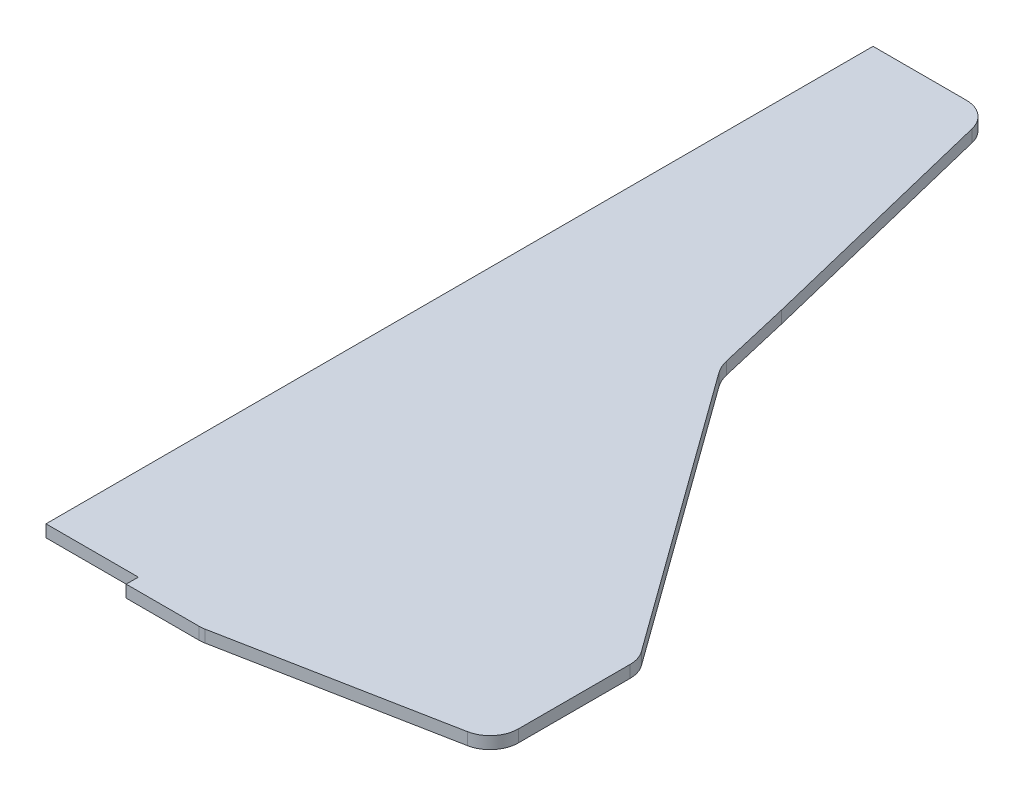
ISO-10303-21;
HEADER;
FILE_DESCRIPTION(('STEP AP214'),'2;1');
FILE_NAME('part.step','',(''),(''),'','','');
FILE_SCHEMA(('AUTOMOTIVE_DESIGN { 1 0 10303 214 1 1 1 1 }'));
ENDSEC;
DATA;
#1=APPLICATION_CONTEXT('core data for automotive mechanical design processes');
#2=APPLICATION_PROTOCOL_DEFINITION('international standard','automotive_design',2000,#1);
#3=PRODUCT_CONTEXT('',#1,'mechanical');
#4=PRODUCT('Part','Part','',(#3));
#5=PRODUCT_RELATED_PRODUCT_CATEGORY('part','',(#4));
#6=PRODUCT_DEFINITION_FORMATION('','',#4);
#7=PRODUCT_DEFINITION_CONTEXT('part definition',#1,'design');
#8=PRODUCT_DEFINITION('design','',#6,#7);
#9=PRODUCT_DEFINITION_SHAPE('','',#8);
#10=(LENGTH_UNIT() NAMED_UNIT(*) SI_UNIT(.MILLI.,.METRE.));
#11=(NAMED_UNIT(*) PLANE_ANGLE_UNIT() SI_UNIT($,.RADIAN.));
#12=(NAMED_UNIT(*) SI_UNIT($,.STERADIAN.) SOLID_ANGLE_UNIT());
#13=UNCERTAINTY_MEASURE_WITH_UNIT(LENGTH_MEASURE(1.E-05),#10,'distance_accuracy_value','');
#14=(GEOMETRIC_REPRESENTATION_CONTEXT(3) GLOBAL_UNCERTAINTY_ASSIGNED_CONTEXT((#13)) GLOBAL_UNIT_ASSIGNED_CONTEXT((#10,
#11,#12)) REPRESENTATION_CONTEXT('',''));
#15=CARTESIAN_POINT('',(0.,0.,0.));
#16=DIRECTION('',(0.,0.,1.));
#17=DIRECTION('',(1.,0.,0.));
#18=AXIS2_PLACEMENT_3D('',#15,#16,#17);
#19=CARTESIAN_POINT('',(0.,3.,18.1954132350214));
#20=DIRECTION('',(0.,0.,1.));
#21=DIRECTION('',(1.,0.,0.));
#22=AXIS2_PLACEMENT_3D('',#19,#20,#21);
#23=PLANE('',#22);
#24=DIRECTION('',(-1.,0.,0.));
#25=VECTOR('',#24,1.);
#26=CARTESIAN_POINT('',(0.,0.,18.1954132350214));
#27=LINE('',#26,#25);
#28=CARTESIAN_POINT('',(0.,0.,18.1954132350214));
#29=VERTEX_POINT('',#28);
#30=CARTESIAN_POINT('',(-22.78,0.,18.1954132350214));
#31=VERTEX_POINT('',#30);
#32=EDGE_CURVE('E186',#29,#31,#27,.T.);
#33=ORIENTED_EDGE('',*,*,#32,.F.);
#34=DIRECTION('',(0.,-1.,0.));
#35=VECTOR('',#34,1.);
#36=CARTESIAN_POINT('',(0.,3.,18.1954132350214));
#37=LINE('',#36,#35);
#38=CARTESIAN_POINT('',(0.,3.,18.1954132350214));
#39=VERTEX_POINT('',#38);
#40=EDGE_CURVE('E11',#39,#29,#37,.T.);
#41=ORIENTED_EDGE('',*,*,#40,.F.);
#42=DIRECTION('',(-1.,0.,0.));
#43=VECTOR('',#42,1.);
#44=CARTESIAN_POINT('',(0.,3.,18.1954132350214));
#45=LINE('',#44,#43);
#46=CARTESIAN_POINT('',(-22.78,3.,18.1954132350214));
#47=VERTEX_POINT('',#46);
#48=EDGE_CURVE('E242',#39,#47,#45,.T.);
#49=ORIENTED_EDGE('',*,*,#48,.T.);
#50=DIRECTION('',(0.,-1.,0.));
#51=VECTOR('',#50,1.);
#52=CARTESIAN_POINT('',(-22.78,3.,18.1954132350214));
#53=LINE('',#52,#51);
#54=EDGE_CURVE('E62',#47,#31,#53,.T.);
#55=ORIENTED_EDGE('',*,*,#54,.T.);
#56=EDGE_LOOP('',(#33,#41,#49,#55));
#57=FACE_BOUND('',#56,.T.);
#58=ADVANCED_FACE('F45',(#57),#23,.T.);
#59=CARTESIAN_POINT('',(0.,3.,0.));
#60=DIRECTION('',(1.,0.,0.));
#61=DIRECTION('',(0.,0.,-1.));
#62=AXIS2_PLACEMENT_3D('',#59,#60,#61);
#63=PLANE('',#62);
#64=DIRECTION('',(0.,0.,1.));
#65=VECTOR('',#64,1.);
#66=CARTESIAN_POINT('',(0.,0.,0.));
#67=LINE('',#66,#65);
#68=CARTESIAN_POINT('',(0.,0.,21.1954132350214));
#69=VERTEX_POINT('',#68);
#70=EDGE_CURVE('E189',#29,#69,#67,.T.);
#71=ORIENTED_EDGE('',*,*,#70,.T.);
#72=DIRECTION('',(0.,-1.,0.));
#73=VECTOR('',#72,1.);
#74=CARTESIAN_POINT('',(0.,3.,21.1954132350214));
#75=LINE('',#74,#73);
#76=CARTESIAN_POINT('',(0.,3.,21.1954132350214));
#77=VERTEX_POINT('',#76);
#78=EDGE_CURVE('E54',#77,#69,#75,.T.);
#79=ORIENTED_EDGE('',*,*,#78,.F.);
#80=DIRECTION('',(0.,0.,1.));
#81=VECTOR('',#80,1.);
#82=CARTESIAN_POINT('',(0.,3.,0.));
#83=LINE('',#82,#81);
#84=EDGE_CURVE('E297',#39,#77,#83,.T.);
#85=ORIENTED_EDGE('',*,*,#84,.F.);
#86=ORIENTED_EDGE('',*,*,#40,.T.);
#87=EDGE_LOOP('',(#71,#79,#85,#86));
#88=FACE_BOUND('',#87,.T.);
#89=ADVANCED_FACE('F285',(#88),#63,.F.);
#90=CARTESIAN_POINT('',(0.,3.,21.1954132350214));
#91=DIRECTION('',(0.,0.,1.));
#92=DIRECTION('',(1.,0.,0.));
#93=AXIS2_PLACEMENT_3D('',#90,#91,#92);
#94=PLANE('',#93);
#95=DIRECTION('',(-1.,0.,0.));
#96=VECTOR('',#95,1.);
#97=CARTESIAN_POINT('',(0.,0.,21.1954132350214));
#98=LINE('',#97,#96);
#99=CARTESIAN_POINT('',(18.0015919325886,0.,21.1954132350214));
#100=VERTEX_POINT('',#99);
#101=EDGE_CURVE('E193',#100,#69,#98,.T.);
#102=ORIENTED_EDGE('',*,*,#101,.F.);
#103=DIRECTION('',(0.,-1.,0.));
#104=VECTOR('',#103,1.);
#105=CARTESIAN_POINT('',(18.0015919325886,3.,21.1954132350214));
#106=LINE('',#105,#104);
#107=CARTESIAN_POINT('',(18.0015919325886,3.,21.1954132350214));
#108=VERTEX_POINT('',#107);
#109=EDGE_CURVE('E273',#108,#100,#106,.T.);
#110=ORIENTED_EDGE('',*,*,#109,.F.);
#111=DIRECTION('',(-1.,0.,0.));
#112=VECTOR('',#111,1.);
#113=CARTESIAN_POINT('',(0.,3.,21.1954132350214));
#114=LINE('',#113,#112);
#115=EDGE_CURVE('E282',#108,#77,#114,.T.);
#116=ORIENTED_EDGE('',*,*,#115,.T.);
#117=ORIENTED_EDGE('',*,*,#78,.T.);
#118=EDGE_LOOP('',(#102,#110,#116,#117));
#119=FACE_BOUND('',#118,.T.);
#120=ADVANCED_FACE('F280',(#119),#94,.T.);
#121=CARTESIAN_POINT('',(18.0015919325886,3.,14.1954132350214));
#122=DIRECTION('',(0.,-1.,0.));
#123=DIRECTION('',(0.,0.,-1.));
#124=AXIS2_PLACEMENT_3D('',#121,#122,#123);
#125=CYLINDRICAL_SURFACE('',#124,7.);
#126=CARTESIAN_POINT('',(18.0015919325886,0.,14.1954132350214));
#127=DIRECTION('',(0.,1.,0.));
#128=DIRECTION('',(0.,0.,1.));
#129=AXIS2_PLACEMENT_3D('',#126,#127,#128);
#130=CIRCLE('',#129,7.);
#131=CARTESIAN_POINT('',(19.3262832462842,0.,21.0689271051914));
#132=VERTEX_POINT('',#131);
#133=EDGE_CURVE('E197',#132,#100,#130,.F.);
#134=ORIENTED_EDGE('',*,*,#133,.F.);
#135=DIRECTION('',(0.,-1.,0.));
#136=VECTOR('',#135,1.);
#137=CARTESIAN_POINT('',(19.3262832462842,3.,21.0689271051914));
#138=LINE('',#137,#136);
#139=CARTESIAN_POINT('',(19.3262832462842,3.,21.0689271051914));
#140=VERTEX_POINT('',#139);
#141=EDGE_CURVE('E270',#140,#132,#138,.T.);
#142=ORIENTED_EDGE('',*,*,#141,.F.);
#143=CARTESIAN_POINT('',(18.0015919325886,3.,14.1954132350214));
#144=DIRECTION('',(0.,1.,0.));
#145=DIRECTION('',(0.,0.,1.));
#146=AXIS2_PLACEMENT_3D('',#143,#144,#145);
#147=CIRCLE('',#146,7.);
#148=EDGE_CURVE('E294',#140,#108,#147,.F.);
#149=ORIENTED_EDGE('',*,*,#148,.T.);
#150=ORIENTED_EDGE('',*,*,#109,.T.);
#151=EDGE_LOOP('',(#134,#142,#149,#150));
#152=FACE_BOUND('',#151,.T.);
#153=ADVANCED_FACE('F291',(#152),#125,.T.);
#154=CARTESIAN_POINT('',(4.60719318299574,3.,23.9056495037539));
#155=DIRECTION('',(0.189241616242226,0.,0.98193055288143));
#156=DIRECTION('',(0.98193055288143,0.,-0.189241616242226));
#157=AXIS2_PLACEMENT_3D('',#154,#155,#156);
#158=PLANE('',#157);
#159=DIRECTION('',(-0.98193055288143,0.,0.189241616242226));
#160=VECTOR('',#159,1.);
#161=CARTESIAN_POINT('',(4.60719318299574,0.,23.9056495037539));
#162=LINE('',#161,#160);
#163=CARTESIAN_POINT('',(73.6126221985287,0.,10.606644927445));
#164=VERTEX_POINT('',#163);
#165=EDGE_CURVE('E201',#164,#132,#162,.T.);
#166=ORIENTED_EDGE('',*,*,#165,.F.);
#167=DIRECTION('',(0.,-1.,0.));
#168=VECTOR('',#167,1.);
#169=CARTESIAN_POINT('',(73.6126221985287,3.,10.606644927445));
#170=LINE('',#169,#168);
#171=CARTESIAN_POINT('',(73.6126221985287,3.,10.606644927445));
#172=VERTEX_POINT('',#171);
#173=EDGE_CURVE('E267',#172,#164,#170,.T.);
#174=ORIENTED_EDGE('',*,*,#173,.F.);
#175=DIRECTION('',(-0.98193055288143,0.,0.189241616242226));
#176=VECTOR('',#175,1.);
#177=CARTESIAN_POINT('',(4.60719318299574,3.,23.9056495037539));
#178=LINE('',#177,#176);
#179=EDGE_CURVE('E302',#172,#140,#178,.T.);
#180=ORIENTED_EDGE('',*,*,#179,.T.);
#181=ORIENTED_EDGE('',*,*,#141,.T.);
#182=EDGE_LOOP('',(#166,#174,#180,#181));
#183=FACE_BOUND('',#182,.T.);
#184=ADVANCED_FACE('F458',(#183),#158,.T.);
#185=CARTESIAN_POINT('',(72.2879308848331,3.,3.73313105727499));
#186=DIRECTION('',(0.,-1.,0.));
#187=DIRECTION('',(0.,0.,-1.));
#188=AXIS2_PLACEMENT_3D('',#185,#186,#187);
#189=CYLINDRICAL_SURFACE('',#188,7.);
#190=CARTESIAN_POINT('',(72.2879308848331,0.,3.73313105727499));
#191=DIRECTION('',(0.,1.,0.));
#192=DIRECTION('',(0.,0.,1.));
#193=AXIS2_PLACEMENT_3D('',#190,#191,#192);
#194=CIRCLE('',#193,7.);
#195=CARTESIAN_POINT('',(79.2879308848331,0.,3.73313105727498));
#196=VERTEX_POINT('',#195);
#197=EDGE_CURVE('E205',#196,#164,#194,.F.);
#198=ORIENTED_EDGE('',*,*,#197,.F.);
#199=DIRECTION('',(0.,-1.,0.));
#200=VECTOR('',#199,1.);
#201=CARTESIAN_POINT('',(79.2879308848331,3.,3.73313105727498));
#202=LINE('',#201,#200);
#203=CARTESIAN_POINT('',(79.2879308848331,3.,3.73313105727498));
#204=VERTEX_POINT('',#203);
#205=EDGE_CURVE('E264',#204,#196,#202,.T.);
#206=ORIENTED_EDGE('',*,*,#205,.F.);
#207=CARTESIAN_POINT('',(72.2879308848331,3.,3.73313105727499));
#208=DIRECTION('',(0.,1.,0.));
#209=DIRECTION('',(0.,0.,1.));
#210=AXIS2_PLACEMENT_3D('',#207,#208,#209);
#211=CIRCLE('',#210,7.);
#212=EDGE_CURVE('E309',#204,#172,#211,.F.);
#213=ORIENTED_EDGE('',*,*,#212,.T.);
#214=ORIENTED_EDGE('',*,*,#173,.T.);
#215=EDGE_LOOP('',(#198,#206,#213,#214));
#216=FACE_BOUND('',#215,.T.);
#217=ADVANCED_FACE('F447',(#216),#189,.T.);
#218=CARTESIAN_POINT('',(79.2879308848331,3.,0.));
#219=DIRECTION('',(1.,0.,0.));
#220=DIRECTION('',(0.,0.,-1.));
#221=AXIS2_PLACEMENT_3D('',#218,#219,#220);
#222=PLANE('',#221);
#223=DIRECTION('',(0.,0.,1.));
#224=VECTOR('',#223,1.);
#225=CARTESIAN_POINT('',(79.2879308848331,0.,0.));
#226=LINE('',#225,#224);
#227=CARTESIAN_POINT('',(79.2879308848331,0.,-23.8199252624577));
#228=VERTEX_POINT('',#227);
#229=EDGE_CURVE('E209',#228,#196,#226,.T.);
#230=ORIENTED_EDGE('',*,*,#229,.F.);
#231=DIRECTION('',(0.,-1.,0.));
#232=VECTOR('',#231,1.);
#233=CARTESIAN_POINT('',(79.2879308848331,3.,-23.8199252624577));
#234=LINE('',#233,#232);
#235=CARTESIAN_POINT('',(79.2879308848331,3.,-23.8199252624577));
#236=VERTEX_POINT('',#235);
#237=EDGE_CURVE('E261',#236,#228,#234,.T.);
#238=ORIENTED_EDGE('',*,*,#237,.F.);
#239=DIRECTION('',(0.,0.,1.));
#240=VECTOR('',#239,1.);
#241=CARTESIAN_POINT('',(79.2879308848331,3.,0.));
#242=LINE('',#241,#240);
#243=EDGE_CURVE('E313',#236,#204,#242,.T.);
#244=ORIENTED_EDGE('',*,*,#243,.T.);
#245=ORIENTED_EDGE('',*,*,#205,.T.);
#246=EDGE_LOOP('',(#230,#238,#244,#245));
#247=FACE_BOUND('',#246,.T.);
#248=ADVANCED_FACE('F436',(#247),#222,.T.);
#249=CARTESIAN_POINT('',(72.2879308848331,3.,-23.8199252624577));
#250=DIRECTION('',(0.,-1.,0.));
#251=DIRECTION('',(0.,0.,-1.));
#252=AXIS2_PLACEMENT_3D('',#249,#250,#251);
#253=CYLINDRICAL_SURFACE('',#252,7.00000000000009);
#254=CARTESIAN_POINT('',(72.2879308848331,0.,-23.8199252624577));
#255=DIRECTION('',(0.,1.,0.));
#256=DIRECTION('',(0.,0.,1.));
#257=AXIS2_PLACEMENT_3D('',#254,#255,#256);
#258=CIRCLE('',#257,7.00000000000009);
#259=CARTESIAN_POINT('',(77.9594100274223,0.,-27.9228905724716));
#260=VERTEX_POINT('',#259);
#261=EDGE_CURVE('E213',#228,#260,#258,.T.);
#262=ORIENTED_EDGE('',*,*,#261,.T.);
#263=DIRECTION('',(0.,-1.,0.));
#264=VECTOR('',#263,1.);
#265=CARTESIAN_POINT('',(77.9594100274223,3.,-27.9228905724716));
#266=LINE('',#265,#264);
#267=CARTESIAN_POINT('',(77.9594100274223,3.,-27.9228905724716));
#268=VERTEX_POINT('',#267);
#269=EDGE_CURVE('E258',#268,#260,#266,.T.);
#270=ORIENTED_EDGE('',*,*,#269,.F.);
#271=CARTESIAN_POINT('',(72.2879308848331,3.,-23.8199252624577));
#272=DIRECTION('',(0.,1.,0.));
#273=DIRECTION('',(0.,0.,1.));
#274=AXIS2_PLACEMENT_3D('',#271,#272,#273);
#275=CIRCLE('',#274,7.00000000000009);
#276=EDGE_CURVE('E317',#236,#268,#275,.T.);
#277=ORIENTED_EDGE('',*,*,#276,.F.);
#278=ORIENTED_EDGE('',*,*,#237,.T.);
#279=EDGE_LOOP('',(#262,#270,#277,#278));
#280=FACE_BOUND('',#279,.T.);
#281=ADVANCED_FACE('F425',(#280),#253,.T.);
#282=CARTESIAN_POINT('',(64.4363157483243,3.,-46.6156996391202));
#283=DIRECTION('',(0.810211306084161,0.,-0.58613790143054));
#284=DIRECTION('',(-0.58613790143054,0.,-0.810211306084161));
#285=AXIS2_PLACEMENT_3D('',#282,#283,#284);
#286=PLANE('',#285);
#287=DIRECTION('',(0.58613790143054,0.,0.810211306084161));
#288=VECTOR('',#287,1.);
#289=CARTESIAN_POINT('',(64.4363157483243,0.,-46.6156996391202));
#290=LINE('',#289,#288);
#291=CARTESIAN_POINT('',(27.9956440589423,0.,-96.9871977660624));
#292=VERTEX_POINT('',#291);
#293=EDGE_CURVE('E217',#292,#260,#290,.T.);
#294=ORIENTED_EDGE('',*,*,#293,.F.);
#295=DIRECTION('',(0.,-1.,0.));
#296=VECTOR('',#295,1.);
#297=CARTESIAN_POINT('',(27.9956440589423,3.,-96.9871977660624));
#298=LINE('',#297,#296);
#299=CARTESIAN_POINT('',(27.9956440589423,3.,-96.9871977660624));
#300=VERTEX_POINT('',#299);
#301=EDGE_CURVE('E255',#300,#292,#298,.T.);
#302=ORIENTED_EDGE('',*,*,#301,.F.);
#303=DIRECTION('',(0.58613790143054,0.,0.810211306084161));
#304=VECTOR('',#303,1.);
#305=CARTESIAN_POINT('',(64.4363157483243,3.,-46.6156996391202));
#306=LINE('',#305,#304);
#307=EDGE_CURVE('E320',#300,#268,#306,.T.);
#308=ORIENTED_EDGE('',*,*,#307,.T.);
#309=ORIENTED_EDGE('',*,*,#269,.T.);
#310=EDGE_LOOP('',(#294,#302,#308,#309));
#311=FACE_BOUND('',#310,.T.);
#312=ADVANCED_FACE('F415',(#311),#286,.T.);
#313=CARTESIAN_POINT('',(36.0977571197839,3.,-102.848576780368));
#314=DIRECTION('',(0.,-1.,0.));
#315=DIRECTION('',(0.,0.,-1.));
#316=AXIS2_PLACEMENT_3D('',#313,#314,#315);
#317=CYLINDRICAL_SURFACE('',#316,10.);
#318=CARTESIAN_POINT('',(36.0977571197839,0.,-102.848576780368));
#319=DIRECTION('',(0.,1.,0.));
#320=DIRECTION('',(0.,0.,1.));
#321=AXIS2_PLACEMENT_3D('',#318,#319,#320);
#322=CIRCLE('',#321,10.);
#323=CARTESIAN_POINT('',(26.358179585097,0.,-100.581281156541));
#324=VERTEX_POINT('',#323);
#325=EDGE_CURVE('E221',#324,#292,#322,.T.);
#326=ORIENTED_EDGE('',*,*,#325,.F.);
#327=DIRECTION('',(0.,-1.,0.));
#328=VECTOR('',#327,1.);
#329=CARTESIAN_POINT('',(26.358179585097,3.,-100.581281156541));
#330=LINE('',#329,#328);
#331=CARTESIAN_POINT('',(26.358179585097,3.,-100.581281156541));
#332=VERTEX_POINT('',#331);
#333=EDGE_CURVE('E252',#332,#324,#330,.T.);
#334=ORIENTED_EDGE('',*,*,#333,.F.);
#335=CARTESIAN_POINT('',(36.0977571197839,3.,-102.848576780368));
#336=DIRECTION('',(0.,1.,0.));
#337=DIRECTION('',(0.,0.,1.));
#338=AXIS2_PLACEMENT_3D('',#335,#336,#337);
#339=CIRCLE('',#338,10.);
#340=EDGE_CURVE('E324',#332,#300,#339,.T.);
#341=ORIENTED_EDGE('',*,*,#340,.T.);
#342=ORIENTED_EDGE('',*,*,#301,.T.);
#343=EDGE_LOOP('',(#326,#334,#341,#342));
#344=FACE_BOUND('',#343,.T.);
#345=ADVANCED_FACE('F339',(#344),#317,.F.);
#346=CARTESIAN_POINT('',(47.2140661865212,3.,-10.9910563642541));
#347=DIRECTION('',(0.973957753468682,0.,-0.226729562382674));
#348=DIRECTION('',(-0.226729562382674,0.,-0.973957753468682));
#349=AXIS2_PLACEMENT_3D('',#346,#347,#348);
#350=PLANE('',#349);
#351=DIRECTION('',(0.226729562382674,0.,0.973957753468682));
#352=VECTOR('',#351,1.);
#353=CARTESIAN_POINT('',(47.2140661865212,0.,-10.9910563642541));
#354=LINE('',#353,#352);
#355=CARTESIAN_POINT('',(22.262888033826,0.,-118.173345098971));
#356=VERTEX_POINT('',#355);
#357=EDGE_CURVE('E225',#356,#324,#354,.T.);
#358=ORIENTED_EDGE('',*,*,#357,.F.);
#359=DIRECTION('',(0.,-1.,0.));
#360=VECTOR('',#359,1.);
#361=CARTESIAN_POINT('',(22.262888033826,3.,-118.173345098971));
#362=LINE('',#361,#360);
#363=CARTESIAN_POINT('',(22.262888033826,3.,-118.173345098971));
#364=VERTEX_POINT('',#363);
#365=EDGE_CURVE('E249',#364,#356,#362,.T.);
#366=ORIENTED_EDGE('',*,*,#365,.F.);
#367=DIRECTION('',(0.226729562382674,0.,0.973957753468682));
#368=VECTOR('',#367,1.);
#369=CARTESIAN_POINT('',(47.2140661865212,3.,-10.9910563642541));
#370=LINE('',#369,#368);
#371=EDGE_CURVE('E328',#364,#332,#370,.T.);
#372=ORIENTED_EDGE('',*,*,#371,.T.);
#373=ORIENTED_EDGE('',*,*,#333,.T.);
#374=EDGE_LOOP('',(#358,#366,#372,#373));
#375=FACE_BOUND('',#374,.T.);
#376=ADVANCED_FACE('F334',(#375),#350,.T.);
#377=CARTESIAN_POINT('',(48.2788902537105,3.,-11.8086527415871));
#378=DIRECTION('',(-0.971365832149907,0.,0.237588762637713));
#379=DIRECTION('',(0.237588762637713,0.,0.971365832149907));
#380=AXIS2_PLACEMENT_3D('',#377,#378,#379);
#381=PLANE('',#380);
#382=DIRECTION('',(-0.237588762637713,0.,-0.971365832149907));
#383=VECTOR('',#382,1.);
#384=CARTESIAN_POINT('',(48.2788902537105,0.,-11.8086527415871));
#385=LINE('',#384,#383);
#386=CARTESIAN_POINT('',(7.02615627357946,0.,-180.467708103443));
#387=VERTEX_POINT('',#386);
#388=EDGE_CURVE('E229',#356,#387,#385,.T.);
#389=ORIENTED_EDGE('',*,*,#388,.T.);
#390=DIRECTION('',(0.,-1.,0.));
#391=VECTOR('',#390,1.);
#392=CARTESIAN_POINT('',(7.02615627357946,3.,-180.467708103443));
#393=LINE('',#392,#391);
#394=CARTESIAN_POINT('',(7.02615627357946,3.,-180.467708103443));
#395=VERTEX_POINT('',#394);
#396=EDGE_CURVE('E164',#395,#387,#393,.T.);
#397=ORIENTED_EDGE('',*,*,#396,.F.);
#398=DIRECTION('',(-0.237588762637713,0.,-0.971365832149907));
#399=VECTOR('',#398,1.);
#400=CARTESIAN_POINT('',(48.2788902537105,3.,-11.8086527415871));
#401=LINE('',#400,#399);
#402=EDGE_CURVE('E174',#364,#395,#401,.T.);
#403=ORIENTED_EDGE('',*,*,#402,.F.);
#404=ORIENTED_EDGE('',*,*,#365,.T.);
#405=EDGE_LOOP('',(#389,#397,#403,#404));
#406=FACE_BOUND('',#405,.T.);
#407=ADVANCED_FACE('F343',(#406),#381,.F.);
#408=CARTESIAN_POINT('',(0.2265954485301,3.,-178.804586764979));
#409=DIRECTION('',(0.,-1.,0.));
#410=DIRECTION('',(0.,0.,-1.));
#411=AXIS2_PLACEMENT_3D('',#408,#409,#410);
#412=CYLINDRICAL_SURFACE('',#411,7.);
#413=CARTESIAN_POINT('',(0.2265954485301,0.,-178.804586764979));
#414=DIRECTION('',(0.,1.,0.));
#415=DIRECTION('',(0.,0.,1.));
#416=AXIS2_PLACEMENT_3D('',#413,#414,#415);
#417=CIRCLE('',#416,7.);
#418=CARTESIAN_POINT('',(0.226595448530099,0.,-185.804586764979));
#419=VERTEX_POINT('',#418);
#420=EDGE_CURVE('E159',#419,#387,#417,.F.);
#421=ORIENTED_EDGE('',*,*,#420,.F.);
#422=DIRECTION('',(0.,-1.,0.));
#423=VECTOR('',#422,1.);
#424=CARTESIAN_POINT('',(0.226595448530099,3.,-185.804586764979));
#425=LINE('',#424,#423);
#426=CARTESIAN_POINT('',(0.226595448530099,3.,-185.804586764979));
#427=VERTEX_POINT('',#426);
#428=EDGE_CURVE('E154',#427,#419,#425,.T.);
#429=ORIENTED_EDGE('',*,*,#428,.F.);
#430=CARTESIAN_POINT('',(0.2265954485301,3.,-178.804586764979));
#431=DIRECTION('',(0.,1.,0.));
#432=DIRECTION('',(0.,0.,1.));
#433=AXIS2_PLACEMENT_3D('',#430,#431,#432);
#434=CIRCLE('',#433,7.);
#435=EDGE_CURVE('E157',#427,#395,#434,.F.);
#436=ORIENTED_EDGE('',*,*,#435,.T.);
#437=ORIENTED_EDGE('',*,*,#396,.T.);
#438=EDGE_LOOP('',(#421,#429,#436,#437));
#439=FACE_BOUND('',#438,.T.);
#440=ADVANCED_FACE('F156',(#439),#412,.T.);
#441=CARTESIAN_POINT('',(0.,3.,-185.804586764979));
#442=DIRECTION('',(0.,0.,-1.));
#443=DIRECTION('',(-1.,0.,0.));
#444=AXIS2_PLACEMENT_3D('',#441,#442,#443);
#445=PLANE('',#444);
#446=DIRECTION('',(1.,0.,0.));
#447=VECTOR('',#446,1.);
#448=CARTESIAN_POINT('',(0.,0.,-185.804586764979));
#449=LINE('',#448,#447);
#450=CARTESIAN_POINT('',(-22.7800000000001,0.,-185.804586764979));
#451=VERTEX_POINT('',#450);
#452=EDGE_CURVE('E235',#451,#419,#449,.T.);
#453=ORIENTED_EDGE('',*,*,#452,.F.);
#454=DIRECTION('',(0.,-1.,0.));
#455=VECTOR('',#454,1.);
#456=CARTESIAN_POINT('',(-22.7800000000001,3.,-185.804586764979));
#457=LINE('',#456,#455);
#458=CARTESIAN_POINT('',(-22.7800000000001,3.,-185.804586764979));
#459=VERTEX_POINT('',#458);
#460=EDGE_CURVE('E108',#459,#451,#457,.T.);
#461=ORIENTED_EDGE('',*,*,#460,.F.);
#462=DIRECTION('',(1.,0.,0.));
#463=VECTOR('',#462,1.);
#464=CARTESIAN_POINT('',(0.,3.,-185.804586764979));
#465=LINE('',#464,#463);
#466=EDGE_CURVE('E171',#459,#427,#465,.T.);
#467=ORIENTED_EDGE('',*,*,#466,.T.);
#468=ORIENTED_EDGE('',*,*,#428,.T.);
#469=EDGE_LOOP('',(#453,#461,#467,#468));
#470=FACE_BOUND('',#469,.T.);
#471=ADVANCED_FACE('F178',(#470),#445,.T.);
#472=CARTESIAN_POINT('',(-22.78,3.,0.));
#473=DIRECTION('',(-1.,0.,0.));
#474=DIRECTION('',(0.,0.,1.));
#475=AXIS2_PLACEMENT_3D('',#472,#473,#474);
#476=PLANE('',#475);
#477=DIRECTION('',(0.,0.,-1.));
#478=VECTOR('',#477,1.);
#479=CARTESIAN_POINT('',(-22.78,0.,0.));
#480=LINE('',#479,#478);
#481=EDGE_CURVE('E238',#31,#451,#480,.T.);
#482=ORIENTED_EDGE('',*,*,#481,.F.);
#483=ORIENTED_EDGE('',*,*,#54,.F.);
#484=DIRECTION('',(0.,0.,-1.));
#485=VECTOR('',#484,1.);
#486=CARTESIAN_POINT('',(-22.78,3.,0.));
#487=LINE('',#486,#485);
#488=EDGE_CURVE('E180',#47,#459,#487,.T.);
#489=ORIENTED_EDGE('',*,*,#488,.T.);
#490=ORIENTED_EDGE('',*,*,#460,.T.);
#491=EDGE_LOOP('',(#482,#483,#489,#490));
#492=FACE_BOUND('',#491,.T.);
#493=ADVANCED_FACE('F356',(#492),#476,.T.);
#494=CARTESIAN_POINT('',(0.,3.,0.));
#495=DIRECTION('',(0.,1.,0.));
#496=DIRECTION('',(0.,0.,1.));
#497=AXIS2_PLACEMENT_3D('',#494,#495,#496);
#498=PLANE('',#497);
#499=ORIENTED_EDGE('',*,*,#48,.F.);
#500=ORIENTED_EDGE('',*,*,#84,.T.);
#501=ORIENTED_EDGE('',*,*,#115,.F.);
#502=ORIENTED_EDGE('',*,*,#148,.F.);
#503=ORIENTED_EDGE('',*,*,#179,.F.);
#504=ORIENTED_EDGE('',*,*,#212,.F.);
#505=ORIENTED_EDGE('',*,*,#243,.F.);
#506=ORIENTED_EDGE('',*,*,#276,.T.);
#507=ORIENTED_EDGE('',*,*,#307,.F.);
#508=ORIENTED_EDGE('',*,*,#340,.F.);
#509=ORIENTED_EDGE('',*,*,#371,.F.);
#510=ORIENTED_EDGE('',*,*,#402,.T.);
#511=ORIENTED_EDGE('',*,*,#435,.F.);
#512=ORIENTED_EDGE('',*,*,#466,.F.);
#513=ORIENTED_EDGE('',*,*,#488,.F.);
#514=EDGE_LOOP('',(#499,#500,#501,#502,#503,#504,#505,#506,#507,#508,#509,#510,#511,#512,#513));
#515=FACE_BOUND('',#514,.T.);
#516=ADVANCED_FACE('F169',(#515),#498,.T.);
#517=CARTESIAN_POINT('',(0.,0.,0.));
#518=DIRECTION('',(0.,1.,0.));
#519=DIRECTION('',(0.,0.,1.));
#520=AXIS2_PLACEMENT_3D('',#517,#518,#519);
#521=PLANE('',#520);
#522=ORIENTED_EDGE('',*,*,#32,.T.);
#523=ORIENTED_EDGE('',*,*,#481,.T.);
#524=ORIENTED_EDGE('',*,*,#452,.T.);
#525=ORIENTED_EDGE('',*,*,#420,.T.);
#526=ORIENTED_EDGE('',*,*,#388,.F.);
#527=ORIENTED_EDGE('',*,*,#357,.T.);
#528=ORIENTED_EDGE('',*,*,#325,.T.);
#529=ORIENTED_EDGE('',*,*,#293,.T.);
#530=ORIENTED_EDGE('',*,*,#261,.F.);
#531=ORIENTED_EDGE('',*,*,#229,.T.);
#532=ORIENTED_EDGE('',*,*,#197,.T.);
#533=ORIENTED_EDGE('',*,*,#165,.T.);
#534=ORIENTED_EDGE('',*,*,#133,.T.);
#535=ORIENTED_EDGE('',*,*,#101,.T.);
#536=ORIENTED_EDGE('',*,*,#70,.F.);
#537=EDGE_LOOP('',(#522,#523,#524,#525,#526,#527,#528,#529,#530,#531,#532,#533,#534,#535,#536));
#538=FACE_BOUND('',#537,.T.);
#539=ADVANCED_FACE('F287',(#538),#521,.F.);
#540=CLOSED_SHELL('',(#58,#89,#120,#153,#184,#217,#248,#281,#312,#345,#376,#407,#440,#471,#493,
#516,#539));
#541=MANIFOLD_SOLID_BREP('B2',#540);
#542=ADVANCED_BREP_SHAPE_REPRESENTATION('',(#18,#541),#14);
#543=SHAPE_DEFINITION_REPRESENTATION(#9,#542);
ENDSEC;
END-ISO-10303-21;
